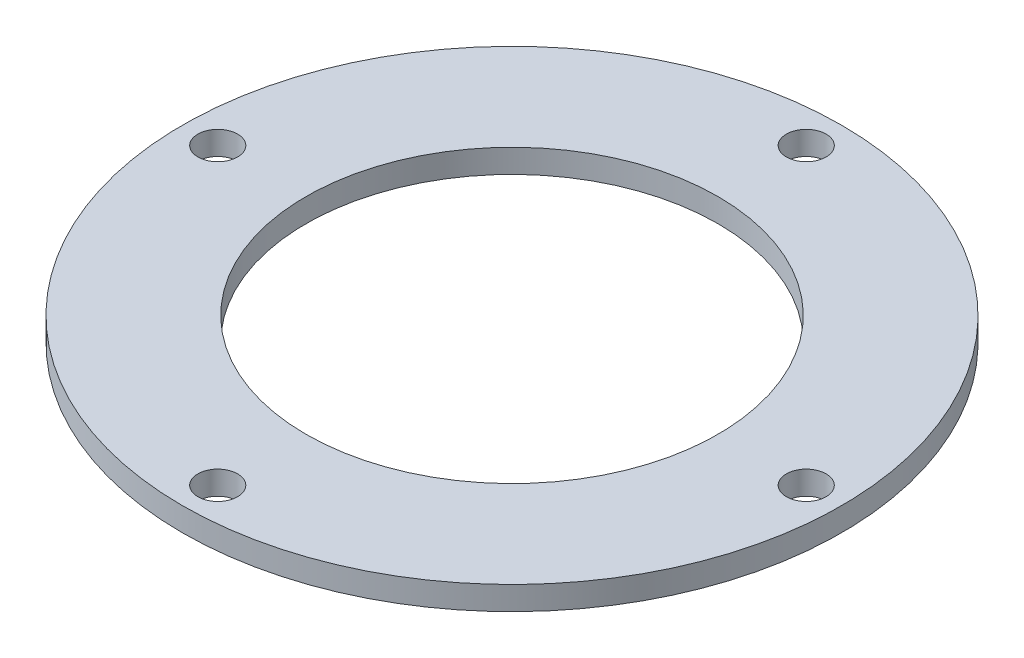
ISO-10303-21;
HEADER;
FILE_DESCRIPTION(('STEP AP214'),'2;1');
FILE_NAME('part.step','',(''),(''),'','','');
FILE_SCHEMA(('AUTOMOTIVE_DESIGN { 1 0 10303 214 1 1 1 1 }'));
ENDSEC;
DATA;
#1=APPLICATION_CONTEXT('core data for automotive mechanical design processes');
#2=APPLICATION_PROTOCOL_DEFINITION('international standard','automotive_design',2000,#1);
#3=PRODUCT_CONTEXT('',#1,'mechanical');
#4=PRODUCT('Part','Part','',(#3));
#5=PRODUCT_RELATED_PRODUCT_CATEGORY('part','',(#4));
#6=PRODUCT_DEFINITION_FORMATION('','',#4);
#7=PRODUCT_DEFINITION_CONTEXT('part definition',#1,'design');
#8=PRODUCT_DEFINITION('design','',#6,#7);
#9=PRODUCT_DEFINITION_SHAPE('','',#8);
#10=(LENGTH_UNIT() NAMED_UNIT(*) SI_UNIT(.MILLI.,.METRE.));
#11=(NAMED_UNIT(*) PLANE_ANGLE_UNIT() SI_UNIT($,.RADIAN.));
#12=(NAMED_UNIT(*) SI_UNIT($,.STERADIAN.) SOLID_ANGLE_UNIT());
#13=UNCERTAINTY_MEASURE_WITH_UNIT(LENGTH_MEASURE(1.E-05),#10,'distance_accuracy_value','');
#14=(GEOMETRIC_REPRESENTATION_CONTEXT(3) GLOBAL_UNCERTAINTY_ASSIGNED_CONTEXT((#13)) GLOBAL_UNIT_ASSIGNED_CONTEXT((#10,
#11,#12)) REPRESENTATION_CONTEXT('',''));
#15=CARTESIAN_POINT('',(0.,0.,0.));
#16=DIRECTION('',(0.,0.,1.));
#17=DIRECTION('',(1.,0.,0.));
#18=AXIS2_PLACEMENT_3D('',#15,#16,#17);
#19=CARTESIAN_POINT('',(0.,4.,-50.));
#20=DIRECTION('',(0.,-1.,0.));
#21=DIRECTION('',(0.,0.,-1.));
#22=AXIS2_PLACEMENT_3D('',#19,#20,#21);
#23=CYLINDRICAL_SURFACE('',#22,3.375);
#24=CARTESIAN_POINT('',(0.,4.,-50.));
#25=DIRECTION('',(0.,1.,0.));
#26=DIRECTION('',(0.,0.,1.));
#27=AXIS2_PLACEMENT_3D('',#24,#25,#26);
#28=CIRCLE('',#27,3.375);
#29=CARTESIAN_POINT('',(0.,4.,-46.625));
#30=VERTEX_POINT('',#29);
#31=EDGE_CURVE('E54',#30,#30,#28,.T.);
#32=ORIENTED_EDGE('',*,*,#31,.T.);
#33=EDGE_LOOP('',(#32));
#34=FACE_BOUND('',#33,.T.);
#35=CARTESIAN_POINT('',(0.,0.,-50.));
#36=DIRECTION('',(0.,1.,0.));
#37=DIRECTION('',(0.,0.,1.));
#38=AXIS2_PLACEMENT_3D('',#35,#36,#37);
#39=CIRCLE('',#38,3.375);
#40=CARTESIAN_POINT('',(0.,0.,-46.625));
#41=VERTEX_POINT('',#40);
#42=EDGE_CURVE('E74',#41,#41,#39,.T.);
#43=ORIENTED_EDGE('',*,*,#42,.F.);
#44=EDGE_LOOP('',(#43));
#45=FACE_BOUND('',#44,.T.);
#46=ADVANCED_FACE('F46',(#34,#45),#23,.F.);
#47=CARTESIAN_POINT('',(0.,4.,0.));
#48=DIRECTION('',(0.,-1.,0.));
#49=DIRECTION('',(0.,0.,-1.));
#50=AXIS2_PLACEMENT_3D('',#47,#48,#49);
#51=CYLINDRICAL_SURFACE('',#50,35.);
#52=CARTESIAN_POINT('',(0.,4.,0.));
#53=DIRECTION('',(0.,1.,0.));
#54=DIRECTION('',(0.,0.,1.));
#55=AXIS2_PLACEMENT_3D('',#52,#53,#54);
#56=CIRCLE('',#55,35.);
#57=CARTESIAN_POINT('',(0.,4.,35.));
#58=VERTEX_POINT('',#57);
#59=EDGE_CURVE('E59',#58,#58,#56,.T.);
#60=ORIENTED_EDGE('',*,*,#59,.T.);
#61=EDGE_LOOP('',(#60));
#62=FACE_BOUND('',#61,.T.);
#63=CARTESIAN_POINT('',(0.,0.,0.));
#64=DIRECTION('',(0.,1.,0.));
#65=DIRECTION('',(0.,0.,1.));
#66=AXIS2_PLACEMENT_3D('',#63,#64,#65);
#67=CIRCLE('',#66,35.);
#68=CARTESIAN_POINT('',(0.,0.,35.));
#69=VERTEX_POINT('',#68);
#70=EDGE_CURVE('E72',#69,#69,#67,.T.);
#71=ORIENTED_EDGE('',*,*,#70,.F.);
#72=EDGE_LOOP('',(#71));
#73=FACE_BOUND('',#72,.T.);
#74=ADVANCED_FACE('F95',(#62,#73),#51,.F.);
#75=CARTESIAN_POINT('',(50.,4.,1.74574066942157E-13));
#76=DIRECTION('',(0.,-1.,0.));
#77=DIRECTION('',(0.,0.,-1.));
#78=AXIS2_PLACEMENT_3D('',#75,#76,#77);
#79=CYLINDRICAL_SURFACE('',#78,3.375);
#80=CARTESIAN_POINT('',(50.,4.,1.74574066942157E-13));
#81=DIRECTION('',(0.,1.,0.));
#82=DIRECTION('',(0.,0.,1.));
#83=AXIS2_PLACEMENT_3D('',#80,#81,#82);
#84=CIRCLE('',#83,3.375);
#85=CARTESIAN_POINT('',(50.,4.,3.37500000000017));
#86=VERTEX_POINT('',#85);
#87=EDGE_CURVE('E88',#86,#86,#84,.T.);
#88=ORIENTED_EDGE('',*,*,#87,.T.);
#89=EDGE_LOOP('',(#88));
#90=FACE_BOUND('',#89,.T.);
#91=CARTESIAN_POINT('',(50.,0.,1.74574066942157E-13));
#92=DIRECTION('',(0.,1.,0.));
#93=DIRECTION('',(0.,0.,1.));
#94=AXIS2_PLACEMENT_3D('',#91,#92,#93);
#95=CIRCLE('',#94,3.375);
#96=CARTESIAN_POINT('',(50.,0.,3.37500000000017));
#97=VERTEX_POINT('',#96);
#98=EDGE_CURVE('E69',#97,#97,#95,.T.);
#99=ORIENTED_EDGE('',*,*,#98,.F.);
#100=EDGE_LOOP('',(#99));
#101=FACE_BOUND('',#100,.T.);
#102=ADVANCED_FACE('F113',(#90,#101),#79,.F.);
#103=CARTESIAN_POINT('',(-3.49148133884313E-13,4.,50.));
#104=DIRECTION('',(0.,-1.,0.));
#105=DIRECTION('',(0.,0.,-1.));
#106=AXIS2_PLACEMENT_3D('',#103,#104,#105);
#107=CYLINDRICAL_SURFACE('',#106,3.375);
#108=CARTESIAN_POINT('',(-3.49148133884313E-13,4.,50.));
#109=DIRECTION('',(0.,1.,0.));
#110=DIRECTION('',(0.,0.,1.));
#111=AXIS2_PLACEMENT_3D('',#108,#109,#110);
#112=CIRCLE('',#111,3.375);
#113=CARTESIAN_POINT('',(-3.49148133884313E-13,4.,53.375));
#114=VERTEX_POINT('',#113);
#115=EDGE_CURVE('E83',#114,#114,#112,.T.);
#116=ORIENTED_EDGE('',*,*,#115,.T.);
#117=EDGE_LOOP('',(#116));
#118=FACE_BOUND('',#117,.T.);
#119=CARTESIAN_POINT('',(-3.49148133884313E-13,0.,50.));
#120=DIRECTION('',(0.,1.,0.));
#121=DIRECTION('',(0.,0.,1.));
#122=AXIS2_PLACEMENT_3D('',#119,#120,#121);
#123=CIRCLE('',#122,3.375);
#124=CARTESIAN_POINT('',(-3.49148133884313E-13,0.,53.375));
#125=VERTEX_POINT('',#124);
#126=EDGE_CURVE('E66',#125,#125,#123,.T.);
#127=ORIENTED_EDGE('',*,*,#126,.F.);
#128=EDGE_LOOP('',(#127));
#129=FACE_BOUND('',#128,.T.);
#130=ADVANCED_FACE('F119',(#118,#129),#107,.F.);
#131=CARTESIAN_POINT('',(-50.,4.,-5.2372220082647E-13));
#132=DIRECTION('',(0.,-1.,0.));
#133=DIRECTION('',(0.,0.,-1.));
#134=AXIS2_PLACEMENT_3D('',#131,#132,#133);
#135=CYLINDRICAL_SURFACE('',#134,3.375);
#136=CARTESIAN_POINT('',(-50.,4.,-5.2372220082647E-13));
#137=DIRECTION('',(0.,1.,0.));
#138=DIRECTION('',(0.,0.,1.));
#139=AXIS2_PLACEMENT_3D('',#136,#137,#138);
#140=CIRCLE('',#139,3.375);
#141=CARTESIAN_POINT('',(-50.,4.,3.37499999999948));
#142=VERTEX_POINT('',#141);
#143=EDGE_CURVE('E79',#142,#142,#140,.T.);
#144=ORIENTED_EDGE('',*,*,#143,.T.);
#145=EDGE_LOOP('',(#144));
#146=FACE_BOUND('',#145,.T.);
#147=CARTESIAN_POINT('',(-50.,0.,-5.2372220082647E-13));
#148=DIRECTION('',(0.,1.,0.));
#149=DIRECTION('',(0.,0.,1.));
#150=AXIS2_PLACEMENT_3D('',#147,#148,#149);
#151=CIRCLE('',#150,3.375);
#152=CARTESIAN_POINT('',(-50.,0.,3.37499999999948));
#153=VERTEX_POINT('',#152);
#154=EDGE_CURVE('E63',#153,#153,#151,.T.);
#155=ORIENTED_EDGE('',*,*,#154,.F.);
#156=EDGE_LOOP('',(#155));
#157=FACE_BOUND('',#156,.T.);
#158=ADVANCED_FACE('F48',(#146,#157),#135,.F.);
#159=CARTESIAN_POINT('',(0.,4.,0.));
#160=DIRECTION('',(0.,-1.,0.));
#161=DIRECTION('',(0.,0.,-1.));
#162=AXIS2_PLACEMENT_3D('',#159,#160,#161);
#163=CYLINDRICAL_SURFACE('',#162,56.);
#164=CARTESIAN_POINT('',(0.,4.,0.));
#165=DIRECTION('',(0.,1.,0.));
#166=DIRECTION('',(0.,0.,1.));
#167=AXIS2_PLACEMENT_3D('',#164,#165,#166);
#168=CIRCLE('',#167,56.);
#169=CARTESIAN_POINT('',(0.,4.,56.));
#170=VERTEX_POINT('',#169);
#171=EDGE_CURVE('E12',#170,#170,#168,.T.);
#172=ORIENTED_EDGE('',*,*,#171,.F.);
#173=EDGE_LOOP('',(#172));
#174=FACE_BOUND('',#173,.T.);
#175=CARTESIAN_POINT('',(0.,0.,0.));
#176=DIRECTION('',(0.,1.,0.));
#177=DIRECTION('',(0.,0.,1.));
#178=AXIS2_PLACEMENT_3D('',#175,#176,#177);
#179=CIRCLE('',#178,56.);
#180=CARTESIAN_POINT('',(0.,0.,56.));
#181=VERTEX_POINT('',#180);
#182=EDGE_CURVE('E50',#181,#181,#179,.T.);
#183=ORIENTED_EDGE('',*,*,#182,.T.);
#184=EDGE_LOOP('',(#183));
#185=FACE_BOUND('',#184,.T.);
#186=ADVANCED_FACE('F102',(#174,#185),#163,.T.);
#187=CARTESIAN_POINT('',(0.,4.,0.));
#188=DIRECTION('',(0.,1.,0.));
#189=DIRECTION('',(0.,0.,1.));
#190=AXIS2_PLACEMENT_3D('',#187,#188,#189);
#191=PLANE('',#190);
#192=ORIENTED_EDGE('',*,*,#143,.F.);
#193=EDGE_LOOP('',(#192));
#194=FACE_BOUND('',#193,.T.);
#195=ORIENTED_EDGE('',*,*,#115,.F.);
#196=EDGE_LOOP('',(#195));
#197=FACE_BOUND('',#196,.T.);
#198=ORIENTED_EDGE('',*,*,#87,.F.);
#199=EDGE_LOOP('',(#198));
#200=FACE_BOUND('',#199,.T.);
#201=ORIENTED_EDGE('',*,*,#59,.F.);
#202=EDGE_LOOP('',(#201));
#203=FACE_BOUND('',#202,.T.);
#204=ORIENTED_EDGE('',*,*,#31,.F.);
#205=EDGE_LOOP('',(#204));
#206=FACE_BOUND('',#205,.T.);
#207=ORIENTED_EDGE('',*,*,#171,.T.);
#208=EDGE_LOOP('',(#207));
#209=FACE_BOUND('',#208,.T.);
#210=ADVANCED_FACE('F98',(#194,#197,#200,#203,#206,#209),#191,.T.);
#211=CARTESIAN_POINT('',(0.,0.,0.));
#212=DIRECTION('',(0.,1.,0.));
#213=DIRECTION('',(0.,0.,1.));
#214=AXIS2_PLACEMENT_3D('',#211,#212,#213);
#215=PLANE('',#214);
#216=ORIENTED_EDGE('',*,*,#154,.T.);
#217=EDGE_LOOP('',(#216));
#218=FACE_BOUND('',#217,.T.);
#219=ORIENTED_EDGE('',*,*,#126,.T.);
#220=EDGE_LOOP('',(#219));
#221=FACE_BOUND('',#220,.T.);
#222=ORIENTED_EDGE('',*,*,#98,.T.);
#223=EDGE_LOOP('',(#222));
#224=FACE_BOUND('',#223,.T.);
#225=ORIENTED_EDGE('',*,*,#70,.T.);
#226=EDGE_LOOP('',(#225));
#227=FACE_BOUND('',#226,.T.);
#228=ORIENTED_EDGE('',*,*,#42,.T.);
#229=EDGE_LOOP('',(#228));
#230=FACE_BOUND('',#229,.T.);
#231=ORIENTED_EDGE('',*,*,#182,.F.);
#232=EDGE_LOOP('',(#231));
#233=FACE_BOUND('',#232,.T.);
#234=ADVANCED_FACE('F101',(#218,#221,#224,#227,#230,#233),#215,.F.);
#235=CLOSED_SHELL('',(#46,#74,#102,#130,#158,#186,#210,#234));
#236=MANIFOLD_SOLID_BREP('B2',#235);
#237=ADVANCED_BREP_SHAPE_REPRESENTATION('',(#18,#236),#14);
#238=SHAPE_DEFINITION_REPRESENTATION(#9,#237);
ENDSEC;
END-ISO-10303-21;
